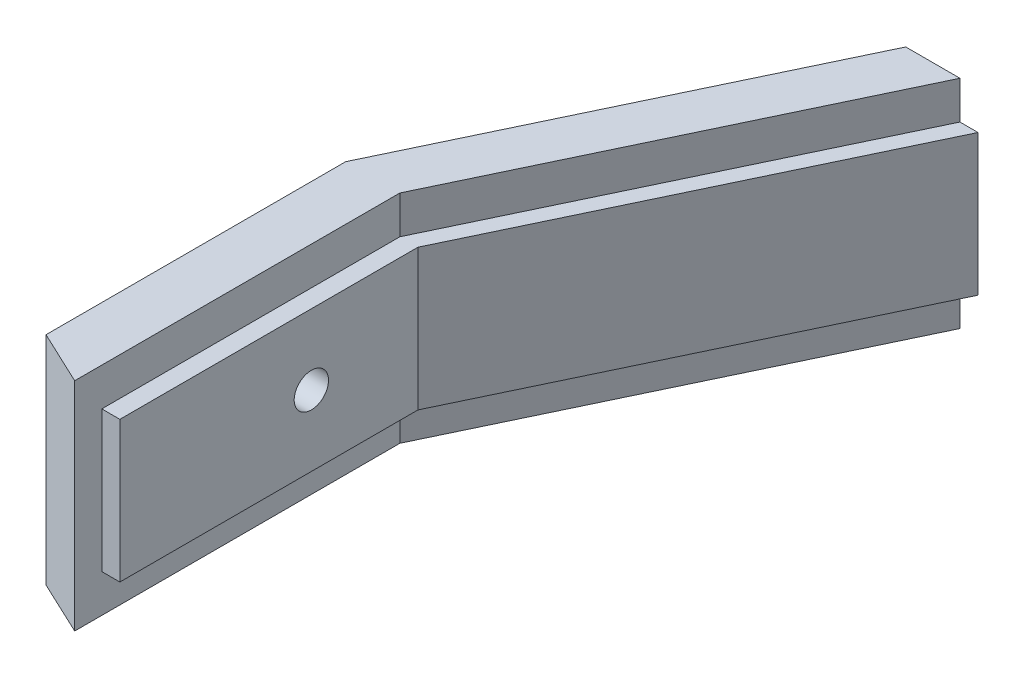
ISO-10303-21;
HEADER;
FILE_DESCRIPTION(('STEP AP214'),'2;1');
FILE_NAME('part.step','',(''),(''),'','','');
FILE_SCHEMA(('AUTOMOTIVE_DESIGN { 1 0 10303 214 1 1 1 1 }'));
ENDSEC;
DATA;
#1=APPLICATION_CONTEXT('core data for automotive mechanical design processes');
#2=APPLICATION_PROTOCOL_DEFINITION('international standard','automotive_design',2000,#1);
#3=PRODUCT_CONTEXT('',#1,'mechanical');
#4=PRODUCT('Part','Part','',(#3));
#5=PRODUCT_RELATED_PRODUCT_CATEGORY('part','',(#4));
#6=PRODUCT_DEFINITION_FORMATION('','',#4);
#7=PRODUCT_DEFINITION_CONTEXT('part definition',#1,'design');
#8=PRODUCT_DEFINITION('design','',#6,#7);
#9=PRODUCT_DEFINITION_SHAPE('','',#8);
#10=(LENGTH_UNIT() NAMED_UNIT(*) SI_UNIT(.MILLI.,.METRE.));
#11=(NAMED_UNIT(*) PLANE_ANGLE_UNIT() SI_UNIT($,.RADIAN.));
#12=(NAMED_UNIT(*) SI_UNIT($,.STERADIAN.) SOLID_ANGLE_UNIT());
#13=UNCERTAINTY_MEASURE_WITH_UNIT(LENGTH_MEASURE(1.E-05),#10,'distance_accuracy_value','');
#14=(GEOMETRIC_REPRESENTATION_CONTEXT(3) GLOBAL_UNCERTAINTY_ASSIGNED_CONTEXT((#13)) GLOBAL_UNIT_ASSIGNED_CONTEXT((#10,
#11,#12)) REPRESENTATION_CONTEXT('',''));
#15=CARTESIAN_POINT('',(0.,0.,0.));
#16=DIRECTION('',(0.,0.,1.));
#17=DIRECTION('',(1.,0.,0.));
#18=AXIS2_PLACEMENT_3D('',#15,#16,#17);
#19=CARTESIAN_POINT('',(-5.68700576850888,3.9,5.9));
#20=DIRECTION('',(1.,0.,0.));
#21=DIRECTION('',(0.,0.,-1.));
#22=AXIS2_PLACEMENT_3D('',#19,#20,#21);
#23=CYLINDRICAL_SURFACE('',#22,0.95);
#24=CARTESIAN_POINT('',(1.,3.9,5.9));
#25=DIRECTION('',(1.,0.,0.));
#26=DIRECTION('',(0.,0.,-1.));
#27=AXIS2_PLACEMENT_3D('',#24,#25,#26);
#28=CIRCLE('',#27,0.95);
#29=CARTESIAN_POINT('',(1.,3.9,4.95));
#30=VERTEX_POINT('',#29);
#31=EDGE_CURVE('E398',#30,#30,#28,.T.);
#32=ORIENTED_EDGE('',*,*,#31,.T.);
#33=EDGE_LOOP('',(#32));
#34=FACE_BOUND('',#33,.T.);
#35=CARTESIAN_POINT('',(-0.5,3.9,5.9));
#36=DIRECTION('',(-1.,0.,0.));
#37=DIRECTION('',(0.,0.,1.));
#38=AXIS2_PLACEMENT_3D('',#35,#36,#37);
#39=CIRCLE('',#38,0.95);
#40=CARTESIAN_POINT('',(-0.5,3.9,6.85));
#41=VERTEX_POINT('',#40);
#42=EDGE_CURVE('E56',#41,#41,#39,.F.);
#43=ORIENTED_EDGE('',*,*,#42,.F.);
#44=EDGE_LOOP('',(#43));
#45=FACE_BOUND('',#44,.T.);
#46=ADVANCED_FACE('F51',(#34,#45),#23,.F.);
#47=CARTESIAN_POINT('',(1.,7.8,0.));
#48=DIRECTION('',(0.,-1.,0.));
#49=DIRECTION('',(0.,0.,-1.));
#50=AXIS2_PLACEMENT_3D('',#47,#48,#49);
#51=PLANE('',#50);
#52=DIRECTION('',(0.,0.,1.));
#53=VECTOR('',#52,1.);
#54=CARTESIAN_POINT('',(0.,7.8,0.));
#55=LINE('',#54,#53);
#56=CARTESIAN_POINT('',(0.,7.8,0.));
#57=VERTEX_POINT('',#56);
#58=CARTESIAN_POINT('',(0.,7.8,16.5));
#59=VERTEX_POINT('',#58);
#60=EDGE_CURVE('E148',#57,#59,#55,.T.);
#61=ORIENTED_EDGE('',*,*,#60,.T.);
#62=DIRECTION('',(-1.,0.,0.));
#63=VECTOR('',#62,1.);
#64=CARTESIAN_POINT('',(1.,7.8,16.5));
#65=LINE('',#64,#63);
#66=CARTESIAN_POINT('',(1.,7.8,16.5));
#67=VERTEX_POINT('',#66);
#68=EDGE_CURVE('E12',#67,#59,#65,.T.);
#69=ORIENTED_EDGE('',*,*,#68,.F.);
#70=DIRECTION('',(0.,0.,1.));
#71=VECTOR('',#70,1.);
#72=CARTESIAN_POINT('',(1.,7.8,0.));
#73=LINE('',#72,#71);
#74=CARTESIAN_POINT('',(1.,7.8,0.));
#75=VERTEX_POINT('',#74);
#76=EDGE_CURVE('E130',#75,#67,#73,.T.);
#77=ORIENTED_EDGE('',*,*,#76,.F.);
#78=DIRECTION('',(0.429933580392348,0.,-0.90286051882393));
#79=VECTOR('',#78,1.);
#80=CARTESIAN_POINT('',(1.,7.8,0.));
#81=LINE('',#80,#79);
#82=CARTESIAN_POINT('',(11.,7.8,-21.));
#83=VERTEX_POINT('',#82);
#84=EDGE_CURVE('E115',#75,#83,#81,.T.);
#85=ORIENTED_EDGE('',*,*,#84,.T.);
#86=DIRECTION('',(1.,0.,0.));
#87=VECTOR('',#86,1.);
#88=CARTESIAN_POINT('',(11.,7.8,-21.));
#89=LINE('',#88,#87);
#90=CARTESIAN_POINT('',(10.,7.8,-21.));
#91=VERTEX_POINT('',#90);
#92=EDGE_CURVE('E284',#91,#83,#89,.T.);
#93=ORIENTED_EDGE('',*,*,#92,.F.);
#94=DIRECTION('',(0.429933580392348,0.,-0.90286051882393));
#95=VECTOR('',#94,1.);
#96=CARTESIAN_POINT('',(0.,7.8,0.));
#97=LINE('',#96,#95);
#98=EDGE_CURVE('E331',#57,#91,#97,.T.);
#99=ORIENTED_EDGE('',*,*,#98,.F.);
#100=EDGE_LOOP('',(#61,#69,#77,#85,#93,#99));
#101=FACE_BOUND('',#100,.T.);
#102=ADVANCED_FACE('F53',(#101),#51,.F.);
#103=CARTESIAN_POINT('',(1.,0.,16.5));
#104=DIRECTION('',(0.,0.,-1.));
#105=DIRECTION('',(-1.,0.,0.));
#106=AXIS2_PLACEMENT_3D('',#103,#104,#105);
#107=PLANE('',#106);
#108=DIRECTION('',(0.,-1.,0.));
#109=VECTOR('',#108,1.);
#110=CARTESIAN_POINT('',(0.,0.,16.5));
#111=LINE('',#110,#109);
#112=CARTESIAN_POINT('',(0.,0.,16.5));
#113=VERTEX_POINT('',#112);
#114=EDGE_CURVE('E138',#59,#113,#111,.T.);
#115=ORIENTED_EDGE('',*,*,#114,.T.);
#116=DIRECTION('',(-1.,0.,0.));
#117=VECTOR('',#116,1.);
#118=CARTESIAN_POINT('',(1.,0.,16.5));
#119=LINE('',#118,#117);
#120=CARTESIAN_POINT('',(1.,0.,16.5));
#121=VERTEX_POINT('',#120);
#122=EDGE_CURVE('E61',#121,#113,#119,.T.);
#123=ORIENTED_EDGE('',*,*,#122,.F.);
#124=DIRECTION('',(0.,-1.,0.));
#125=VECTOR('',#124,1.);
#126=CARTESIAN_POINT('',(1.,0.,16.5));
#127=LINE('',#126,#125);
#128=EDGE_CURVE('E78',#67,#121,#127,.T.);
#129=ORIENTED_EDGE('',*,*,#128,.F.);
#130=ORIENTED_EDGE('',*,*,#68,.T.);
#131=EDGE_LOOP('',(#115,#123,#129,#130));
#132=FACE_BOUND('',#131,.T.);
#133=ADVANCED_FACE('F167',(#132),#107,.F.);
#134=CARTESIAN_POINT('',(1.,0.,0.));
#135=DIRECTION('',(0.,1.,0.));
#136=DIRECTION('',(0.,0.,1.));
#137=AXIS2_PLACEMENT_3D('',#134,#135,#136);
#138=PLANE('',#137);
#139=DIRECTION('',(0.,0.,-1.));
#140=VECTOR('',#139,1.);
#141=CARTESIAN_POINT('',(0.,0.,0.));
#142=LINE('',#141,#140);
#143=CARTESIAN_POINT('',(0.,0.,0.));
#144=VERTEX_POINT('',#143);
#145=EDGE_CURVE('E136',#113,#144,#142,.T.);
#146=ORIENTED_EDGE('',*,*,#145,.T.);
#147=DIRECTION('',(0.429933580392348,0.,-0.90286051882393));
#148=VECTOR('',#147,1.);
#149=CARTESIAN_POINT('',(0.,0.,0.));
#150=LINE('',#149,#148);
#151=CARTESIAN_POINT('',(10.,0.,-21.));
#152=VERTEX_POINT('',#151);
#153=EDGE_CURVE('E126',#144,#152,#150,.T.);
#154=ORIENTED_EDGE('',*,*,#153,.T.);
#155=DIRECTION('',(-1.,0.,0.));
#156=VECTOR('',#155,1.);
#157=CARTESIAN_POINT('',(10.,0.,-21.));
#158=LINE('',#157,#156);
#159=CARTESIAN_POINT('',(11.,0.,-21.));
#160=VERTEX_POINT('',#159);
#161=EDGE_CURVE('E213',#160,#152,#158,.T.);
#162=ORIENTED_EDGE('',*,*,#161,.F.);
#163=DIRECTION('',(0.429933580392348,0.,-0.90286051882393));
#164=VECTOR('',#163,1.);
#165=CARTESIAN_POINT('',(1.,0.,0.));
#166=LINE('',#165,#164);
#167=CARTESIAN_POINT('',(1.,0.,0.));
#168=VERTEX_POINT('',#167);
#169=EDGE_CURVE('E127',#168,#160,#166,.T.);
#170=ORIENTED_EDGE('',*,*,#169,.F.);
#171=DIRECTION('',(0.,0.,-1.));
#172=VECTOR('',#171,1.);
#173=CARTESIAN_POINT('',(1.,0.,0.));
#174=LINE('',#173,#172);
#175=EDGE_CURVE('E135',#121,#168,#174,.T.);
#176=ORIENTED_EDGE('',*,*,#175,.F.);
#177=ORIENTED_EDGE('',*,*,#122,.T.);
#178=EDGE_LOOP('',(#146,#154,#162,#170,#176,#177));
#179=FACE_BOUND('',#178,.T.);
#180=ADVANCED_FACE('F158',(#179),#138,.F.);
#181=CARTESIAN_POINT('',(1.,0.,0.));
#182=DIRECTION('',(1.,0.,0.));
#183=DIRECTION('',(0.,0.,-1.));
#184=AXIS2_PLACEMENT_3D('',#181,#182,#183);
#185=PLANE('',#184);
#186=ORIENTED_EDGE('',*,*,#31,.F.);
#187=EDGE_LOOP('',(#186));
#188=FACE_BOUND('',#187,.T.);
#189=DIRECTION('',(0.,1.,0.));
#190=VECTOR('',#189,1.);
#191=CARTESIAN_POINT('',(1.,0.,0.));
#192=LINE('',#191,#190);
#193=EDGE_CURVE('E120',#168,#75,#192,.T.);
#194=ORIENTED_EDGE('',*,*,#193,.T.);
#195=ORIENTED_EDGE('',*,*,#76,.T.);
#196=ORIENTED_EDGE('',*,*,#128,.T.);
#197=ORIENTED_EDGE('',*,*,#175,.T.);
#198=EDGE_LOOP('',(#194,#195,#196,#197));
#199=FACE_BOUND('',#198,.T.);
#200=ADVANCED_FACE('F133',(#188,#199),#185,.T.);
#201=CARTESIAN_POINT('',(0.,0.,0.));
#202=DIRECTION('',(1.,0.,0.));
#203=DIRECTION('',(0.,0.,-1.));
#204=AXIS2_PLACEMENT_3D('',#201,#202,#203);
#205=PLANE('',#204);
#206=ORIENTED_EDGE('',*,*,#145,.F.);
#207=ORIENTED_EDGE('',*,*,#114,.F.);
#208=ORIENTED_EDGE('',*,*,#60,.F.);
#209=DIRECTION('',(0.,1.,0.));
#210=VECTOR('',#209,1.);
#211=CARTESIAN_POINT('',(0.,0.,0.));
#212=LINE('',#211,#210);
#213=CARTESIAN_POINT('',(0.,9.9,0.));
#214=VERTEX_POINT('',#213);
#215=EDGE_CURVE('E143',#214,#57,#212,.F.);
#216=ORIENTED_EDGE('',*,*,#215,.F.);
#217=DIRECTION('',(0.,0.,-1.));
#218=VECTOR('',#217,1.);
#219=CARTESIAN_POINT('',(0.,9.9,0.));
#220=LINE('',#219,#218);
#221=CARTESIAN_POINT('',(0.,9.9,18.));
#222=VERTEX_POINT('',#221);
#223=EDGE_CURVE('E144',#222,#214,#220,.T.);
#224=ORIENTED_EDGE('',*,*,#223,.F.);
#225=DIRECTION('',(0.,1.,0.));
#226=VECTOR('',#225,1.);
#227=CARTESIAN_POINT('',(0.,9.9,18.));
#228=LINE('',#227,#226);
#229=CARTESIAN_POINT('',(0.,-2.09999999999999,18.));
#230=VERTEX_POINT('',#229);
#231=EDGE_CURVE('E435',#230,#222,#228,.T.);
#232=ORIENTED_EDGE('',*,*,#231,.F.);
#233=DIRECTION('',(0.,0.,1.));
#234=VECTOR('',#233,1.);
#235=CARTESIAN_POINT('',(0.,-2.09999999999999,18.));
#236=LINE('',#235,#234);
#237=CARTESIAN_POINT('',(0.,-2.1,0.));
#238=VERTEX_POINT('',#237);
#239=EDGE_CURVE('E217',#238,#230,#236,.T.);
#240=ORIENTED_EDGE('',*,*,#239,.F.);
#241=DIRECTION('',(0.,1.,0.));
#242=VECTOR('',#241,1.);
#243=CARTESIAN_POINT('',(0.,0.,0.));
#244=LINE('',#243,#242);
#245=EDGE_CURVE('E141',#144,#238,#244,.F.);
#246=ORIENTED_EDGE('',*,*,#245,.F.);
#247=EDGE_LOOP('',(#206,#207,#208,#216,#224,#232,#240,#246));
#248=FACE_BOUND('',#247,.T.);
#249=ADVANCED_FACE('F452',(#248),#205,.T.);
#250=CARTESIAN_POINT('',(-3.,-2.09999999999999,18.));
#251=DIRECTION('',(0.,1.,0.));
#252=DIRECTION('',(0.,0.,1.));
#253=AXIS2_PLACEMENT_3D('',#250,#251,#252);
#254=PLANE('',#253);
#255=ORIENTED_EDGE('',*,*,#239,.T.);
#256=DIRECTION('',(0.904827052466022,0.,0.425779291565067));
#257=VECTOR('',#256,1.);
#258=CARTESIAN_POINT('',(-3.,-2.09999999999999,16.5883071563633));
#259=LINE('',#258,#257);
#260=CARTESIAN_POINT('',(-3.,-2.09999999999999,16.5883071563633));
#261=VERTEX_POINT('',#260);
#262=EDGE_CURVE('E392',#261,#230,#259,.T.);
#263=ORIENTED_EDGE('',*,*,#262,.F.);
#264=DIRECTION('',(0.,0.,1.));
#265=VECTOR('',#264,1.);
#266=CARTESIAN_POINT('',(-3.,-2.09999999999999,18.));
#267=LINE('',#266,#265);
#268=CARTESIAN_POINT('',(-3.,-2.1,0.));
#269=VERTEX_POINT('',#268);
#270=EDGE_CURVE('E151',#269,#261,#267,.T.);
#271=ORIENTED_EDGE('',*,*,#270,.F.);
#272=DIRECTION('',(0.429933580392348,0.,-0.90286051882393));
#273=VECTOR('',#272,1.);
#274=CARTESIAN_POINT('',(-3.,-2.1,0.));
#275=LINE('',#274,#273);
#276=CARTESIAN_POINT('',(7.,-2.1,-21.));
#277=VERTEX_POINT('',#276);
#278=EDGE_CURVE('E329',#269,#277,#275,.T.);
#279=ORIENTED_EDGE('',*,*,#278,.T.);
#280=DIRECTION('',(-1.,0.,0.));
#281=VECTOR('',#280,1.);
#282=CARTESIAN_POINT('',(7.,-2.1,-21.));
#283=LINE('',#282,#281);
#284=CARTESIAN_POINT('',(10.,-2.1,-21.));
#285=VERTEX_POINT('',#284);
#286=EDGE_CURVE('E302',#285,#277,#283,.T.);
#287=ORIENTED_EDGE('',*,*,#286,.F.);
#288=DIRECTION('',(0.429933580392348,0.,-0.90286051882393));
#289=VECTOR('',#288,1.);
#290=CARTESIAN_POINT('',(0.,-2.1,0.));
#291=LINE('',#290,#289);
#292=EDGE_CURVE('E333',#238,#285,#291,.T.);
#293=ORIENTED_EDGE('',*,*,#292,.F.);
#294=EDGE_LOOP('',(#255,#263,#271,#279,#287,#293));
#295=FACE_BOUND('',#294,.T.);
#296=ADVANCED_FACE('F468',(#295),#254,.F.);
#297=CARTESIAN_POINT('',(-3.,9.9,0.));
#298=DIRECTION('',(0.,-1.,0.));
#299=DIRECTION('',(0.,0.,-1.));
#300=AXIS2_PLACEMENT_3D('',#297,#298,#299);
#301=PLANE('',#300);
#302=DIRECTION('',(0.,0.,-1.));
#303=VECTOR('',#302,1.);
#304=CARTESIAN_POINT('',(-3.,9.9,0.));
#305=LINE('',#304,#303);
#306=CARTESIAN_POINT('',(-3.,9.9,16.5883071563633));
#307=VERTEX_POINT('',#306);
#308=CARTESIAN_POINT('',(-3.,9.9,0.));
#309=VERTEX_POINT('',#308);
#310=EDGE_CURVE('E149',#307,#309,#305,.T.);
#311=ORIENTED_EDGE('',*,*,#310,.F.);
#312=DIRECTION('',(-0.904827052466022,0.,-0.425779291565067));
#313=VECTOR('',#312,1.);
#314=CARTESIAN_POINT('',(-3.,9.9,16.5883071563633));
#315=LINE('',#314,#313);
#316=EDGE_CURVE('E69',#222,#307,#315,.T.);
#317=ORIENTED_EDGE('',*,*,#316,.F.);
#318=ORIENTED_EDGE('',*,*,#223,.T.);
#319=DIRECTION('',(0.429933580392348,0.,-0.90286051882393));
#320=VECTOR('',#319,1.);
#321=CARTESIAN_POINT('',(0.,9.9,0.));
#322=LINE('',#321,#320);
#323=CARTESIAN_POINT('',(10.,9.9,-21.));
#324=VERTEX_POINT('',#323);
#325=EDGE_CURVE('E324',#214,#324,#322,.T.);
#326=ORIENTED_EDGE('',*,*,#325,.T.);
#327=DIRECTION('',(1.,0.,0.));
#328=VECTOR('',#327,1.);
#329=CARTESIAN_POINT('',(10.,9.9,-21.));
#330=LINE('',#329,#328);
#331=CARTESIAN_POINT('',(7.,9.9,-21.));
#332=VERTEX_POINT('',#331);
#333=EDGE_CURVE('E294',#332,#324,#330,.T.);
#334=ORIENTED_EDGE('',*,*,#333,.F.);
#335=DIRECTION('',(0.429933580392348,0.,-0.90286051882393));
#336=VECTOR('',#335,1.);
#337=CARTESIAN_POINT('',(-3.,9.9,0.));
#338=LINE('',#337,#336);
#339=EDGE_CURVE('E322',#309,#332,#338,.T.);
#340=ORIENTED_EDGE('',*,*,#339,.F.);
#341=EDGE_LOOP('',(#311,#317,#318,#326,#334,#340));
#342=FACE_BOUND('',#341,.T.);
#343=ADVANCED_FACE('F321',(#342),#301,.F.);
#344=CARTESIAN_POINT('',(-3.,0.,0.));
#345=DIRECTION('',(1.,0.,0.));
#346=DIRECTION('',(0.,0.,-1.));
#347=AXIS2_PLACEMENT_3D('',#344,#345,#346);
#348=PLANE('',#347);
#349=CARTESIAN_POINT('',(-3.,3.9,5.9));
#350=DIRECTION('',(-1.,0.,0.));
#351=DIRECTION('',(0.,0.,1.));
#352=AXIS2_PLACEMENT_3D('',#349,#350,#351);
#353=CIRCLE('',#352,2.5);
#354=CARTESIAN_POINT('',(-3.,3.9,8.4));
#355=VERTEX_POINT('',#354);
#356=EDGE_CURVE('E402',#355,#355,#353,.T.);
#357=ORIENTED_EDGE('',*,*,#356,.F.);
#358=EDGE_LOOP('',(#357));
#359=FACE_BOUND('',#358,.T.);
#360=ORIENTED_EDGE('',*,*,#270,.T.);
#361=DIRECTION('',(0.,1.,0.));
#362=VECTOR('',#361,1.);
#363=CARTESIAN_POINT('',(-3.,-5.41555073626918,16.5883071563633));
#364=LINE('',#363,#362);
#365=EDGE_CURVE('E395',#261,#307,#364,.T.);
#366=ORIENTED_EDGE('',*,*,#365,.T.);
#367=ORIENTED_EDGE('',*,*,#310,.T.);
#368=DIRECTION('',(0.,1.,0.));
#369=VECTOR('',#368,1.);
#370=CARTESIAN_POINT('',(-3.,0.,0.));
#371=LINE('',#370,#369);
#372=EDGE_CURVE('E145',#309,#269,#371,.F.);
#373=ORIENTED_EDGE('',*,*,#372,.T.);
#374=EDGE_LOOP('',(#360,#366,#367,#373));
#375=FACE_BOUND('',#374,.T.);
#376=ADVANCED_FACE('F243',(#359,#375),#348,.F.);
#377=CARTESIAN_POINT('',(0.,0.,-21.));
#378=DIRECTION('',(0.,0.,1.));
#379=DIRECTION('',(1.,0.,0.));
#380=AXIS2_PLACEMENT_3D('',#377,#378,#379);
#381=PLANE('',#380);
#382=DIRECTION('',(0.,-1.,0.));
#383=VECTOR('',#382,1.);
#384=CARTESIAN_POINT('',(11.,0.,-21.));
#385=LINE('',#384,#383);
#386=EDGE_CURVE('E122',#83,#160,#385,.T.);
#387=ORIENTED_EDGE('',*,*,#386,.T.);
#388=ORIENTED_EDGE('',*,*,#161,.T.);
#389=DIRECTION('',(0.,-1.,0.));
#390=VECTOR('',#389,1.);
#391=CARTESIAN_POINT('',(10.,-2.1,-21.));
#392=LINE('',#391,#390);
#393=EDGE_CURVE('E218',#152,#285,#392,.T.);
#394=ORIENTED_EDGE('',*,*,#393,.T.);
#395=ORIENTED_EDGE('',*,*,#286,.T.);
#396=DIRECTION('',(0.,1.,0.));
#397=VECTOR('',#396,1.);
#398=CARTESIAN_POINT('',(7.,9.9,-21.));
#399=LINE('',#398,#397);
#400=EDGE_CURVE('E298',#277,#332,#399,.T.);
#401=ORIENTED_EDGE('',*,*,#400,.T.);
#402=ORIENTED_EDGE('',*,*,#333,.T.);
#403=DIRECTION('',(0.,-1.,0.));
#404=VECTOR('',#403,1.);
#405=CARTESIAN_POINT('',(10.,7.8,-21.));
#406=LINE('',#405,#404);
#407=EDGE_CURVE('E291',#324,#91,#406,.T.);
#408=ORIENTED_EDGE('',*,*,#407,.T.);
#409=ORIENTED_EDGE('',*,*,#92,.T.);
#410=EDGE_LOOP('',(#387,#388,#394,#395,#401,#402,#408,#409));
#411=FACE_BOUND('',#410,.T.);
#412=ADVANCED_FACE('F196',(#411),#381,.F.);
#413=CARTESIAN_POINT('',(0.815157116451017,0.,0.388170055452865));
#414=DIRECTION('',(-0.90286051882393,0.,-0.429933580392348));
#415=DIRECTION('',(-0.429933580392348,0.,0.90286051882393));
#416=AXIS2_PLACEMENT_3D('',#413,#414,#415);
#417=PLANE('',#416);
#418=ORIENTED_EDGE('',*,*,#169,.T.);
#419=ORIENTED_EDGE('',*,*,#386,.F.);
#420=ORIENTED_EDGE('',*,*,#84,.F.);
#421=ORIENTED_EDGE('',*,*,#193,.F.);
#422=EDGE_LOOP('',(#418,#419,#420,#421));
#423=FACE_BOUND('',#422,.T.);
#424=ADVANCED_FACE('F118',(#423),#417,.F.);
#425=CARTESIAN_POINT('',(0.,0.,0.));
#426=DIRECTION('',(-0.90286051882393,0.,-0.429933580392348));
#427=DIRECTION('',(-0.429933580392348,0.,0.90286051882393));
#428=AXIS2_PLACEMENT_3D('',#425,#426,#427);
#429=PLANE('',#428);
#430=ORIENTED_EDGE('',*,*,#292,.T.);
#431=ORIENTED_EDGE('',*,*,#393,.F.);
#432=ORIENTED_EDGE('',*,*,#153,.F.);
#433=ORIENTED_EDGE('',*,*,#245,.T.);
#434=EDGE_LOOP('',(#430,#431,#432,#433));
#435=FACE_BOUND('',#434,.T.);
#436=ADVANCED_FACE('F195',(#435),#429,.F.);
#437=CARTESIAN_POINT('',(-2.44547134935305,0.,-1.1645101663586));
#438=DIRECTION('',(0.90286051882393,0.,0.429933580392348));
#439=DIRECTION('',(0.429933580392348,0.,-0.90286051882393));
#440=AXIS2_PLACEMENT_3D('',#437,#438,#439);
#441=PLANE('',#440);
#442=ORIENTED_EDGE('',*,*,#339,.T.);
#443=ORIENTED_EDGE('',*,*,#400,.F.);
#444=ORIENTED_EDGE('',*,*,#278,.F.);
#445=ORIENTED_EDGE('',*,*,#372,.F.);
#446=EDGE_LOOP('',(#442,#443,#444,#445));
#447=FACE_BOUND('',#446,.T.);
#448=ADVANCED_FACE('F328',(#447),#441,.F.);
#449=CARTESIAN_POINT('',(0.,0.,0.));
#450=DIRECTION('',(-0.90286051882393,0.,-0.429933580392348));
#451=DIRECTION('',(-0.429933580392348,0.,0.90286051882393));
#452=AXIS2_PLACEMENT_3D('',#449,#450,#451);
#453=PLANE('',#452);
#454=ORIENTED_EDGE('',*,*,#98,.T.);
#455=ORIENTED_EDGE('',*,*,#407,.F.);
#456=ORIENTED_EDGE('',*,*,#325,.F.);
#457=ORIENTED_EDGE('',*,*,#215,.T.);
#458=EDGE_LOOP('',(#454,#455,#456,#457));
#459=FACE_BOUND('',#458,.T.);
#460=ADVANCED_FACE('F191',(#459),#453,.F.);
#461=CARTESIAN_POINT('',(-3.,-5.41555073626918,16.5883071563633));
#462=DIRECTION('',(0.425779291565067,0.,-0.904827052466022));
#463=DIRECTION('',(-0.904827052466022,0.,-0.425779291565067));
#464=AXIS2_PLACEMENT_3D('',#461,#462,#463);
#465=PLANE('',#464);
#466=ORIENTED_EDGE('',*,*,#262,.T.);
#467=ORIENTED_EDGE('',*,*,#231,.T.);
#468=ORIENTED_EDGE('',*,*,#316,.T.);
#469=ORIENTED_EDGE('',*,*,#365,.F.);
#470=EDGE_LOOP('',(#466,#467,#468,#469));
#471=FACE_BOUND('',#470,.T.);
#472=ADVANCED_FACE('F187',(#471),#465,.F.);
#473=CARTESIAN_POINT('',(-0.5,3.9,5.9));
#474=DIRECTION('',(-1.,0.,0.));
#475=DIRECTION('',(0.,0.,1.));
#476=AXIS2_PLACEMENT_3D('',#473,#474,#475);
#477=PLANE('',#476);
#478=CARTESIAN_POINT('',(-0.5,3.9,5.9));
#479=DIRECTION('',(-1.,0.,0.));
#480=DIRECTION('',(0.,0.,1.));
#481=AXIS2_PLACEMENT_3D('',#478,#479,#480);
#482=CIRCLE('',#481,2.5);
#483=CARTESIAN_POINT('',(-0.5,3.9,8.4));
#484=VERTEX_POINT('',#483);
#485=EDGE_CURVE('E405',#484,#484,#482,.T.);
#486=ORIENTED_EDGE('',*,*,#485,.T.);
#487=EDGE_LOOP('',(#486));
#488=FACE_BOUND('',#487,.T.);
#489=ORIENTED_EDGE('',*,*,#42,.T.);
#490=EDGE_LOOP('',(#489));
#491=FACE_BOUND('',#490,.T.);
#492=ADVANCED_FACE('F190',(#488,#491),#477,.T.);
#493=CARTESIAN_POINT('',(-0.5,3.9,5.9));
#494=DIRECTION('',(-1.,0.,0.));
#495=DIRECTION('',(0.,0.,1.));
#496=AXIS2_PLACEMENT_3D('',#493,#494,#495);
#497=CYLINDRICAL_SURFACE('',#496,2.5);
#498=ORIENTED_EDGE('',*,*,#485,.F.);
#499=EDGE_LOOP('',(#498));
#500=FACE_BOUND('',#499,.T.);
#501=ORIENTED_EDGE('',*,*,#356,.T.);
#502=EDGE_LOOP('',(#501));
#503=FACE_BOUND('',#502,.T.);
#504=ADVANCED_FACE('F185',(#500,#503),#497,.F.);
#505=CLOSED_SHELL('',(#46,#102,#133,#180,#200,#249,#296,#343,#376,#412,#424,#436,#448,#460,#472,
#492,#504));
#506=MANIFOLD_SOLID_BREP('B2',#505);
#507=ADVANCED_BREP_SHAPE_REPRESENTATION('',(#18,#506),#14);
#508=SHAPE_DEFINITION_REPRESENTATION(#9,#507);
ENDSEC;
END-ISO-10303-21;
